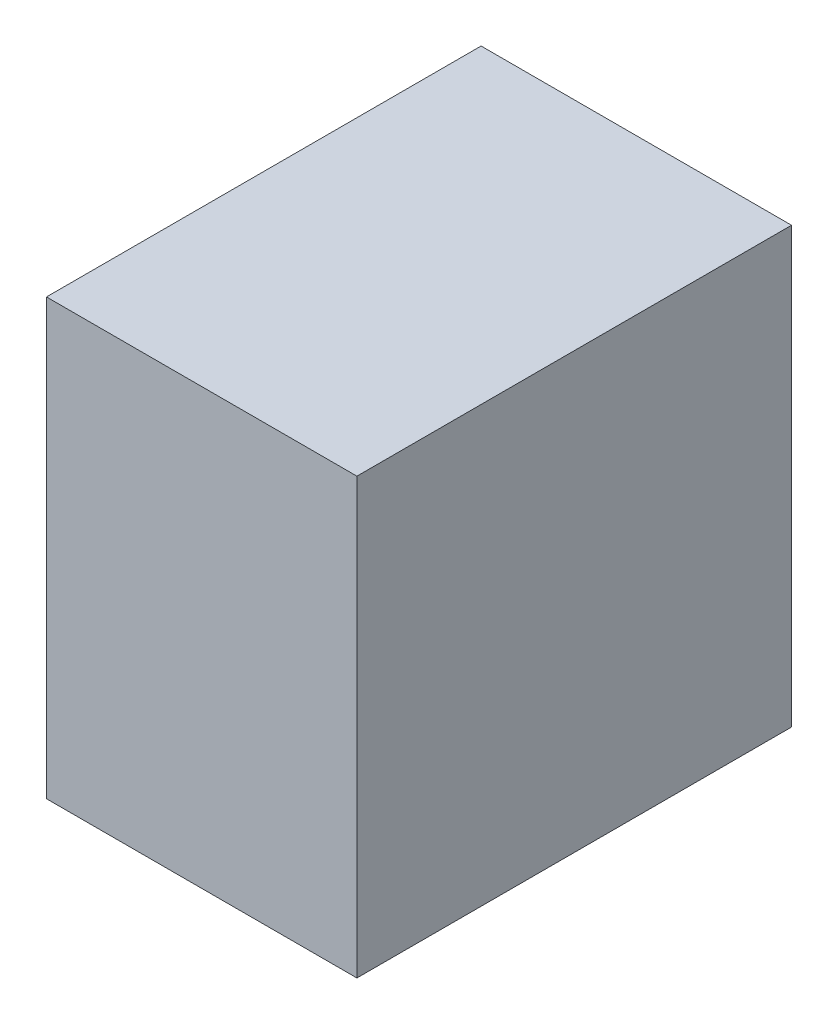
ISO-10303-21;
HEADER;
FILE_DESCRIPTION(('STEP AP214'),'2;1');
FILE_NAME('part.step','',(''),(''),'','','');
FILE_SCHEMA(('AUTOMOTIVE_DESIGN { 1 0 10303 214 1 1 1 1 }'));
ENDSEC;
DATA;
#1=APPLICATION_CONTEXT('core data for automotive mechanical design processes');
#2=APPLICATION_PROTOCOL_DEFINITION('international standard','automotive_design',2000,#1);
#3=PRODUCT_CONTEXT('',#1,'mechanical');
#4=PRODUCT('Part','Part','',(#3));
#5=PRODUCT_RELATED_PRODUCT_CATEGORY('part','',(#4));
#6=PRODUCT_DEFINITION_FORMATION('','',#4);
#7=PRODUCT_DEFINITION_CONTEXT('part definition',#1,'design');
#8=PRODUCT_DEFINITION('design','',#6,#7);
#9=PRODUCT_DEFINITION_SHAPE('','',#8);
#10=(LENGTH_UNIT() NAMED_UNIT(*) SI_UNIT(.MILLI.,.METRE.));
#11=(NAMED_UNIT(*) PLANE_ANGLE_UNIT() SI_UNIT($,.RADIAN.));
#12=(NAMED_UNIT(*) SI_UNIT($,.STERADIAN.) SOLID_ANGLE_UNIT());
#13=UNCERTAINTY_MEASURE_WITH_UNIT(LENGTH_MEASURE(1.E-05),#10,'distance_accuracy_value','');
#14=(GEOMETRIC_REPRESENTATION_CONTEXT(3) GLOBAL_UNCERTAINTY_ASSIGNED_CONTEXT((#13)) GLOBAL_UNIT_ASSIGNED_CONTEXT((#10,
#11,#12)) REPRESENTATION_CONTEXT('',''));
#15=CARTESIAN_POINT('',(0.,0.,0.));
#16=DIRECTION('',(0.,0.,1.));
#17=DIRECTION('',(1.,0.,0.));
#18=AXIS2_PLACEMENT_3D('',#15,#16,#17);
#19=CARTESIAN_POINT('',(15.24,-0.35,-2.08));
#20=DIRECTION('',(-1.,0.,0.));
#21=DIRECTION('',(0.,0.,1.));
#22=AXIS2_PLACEMENT_3D('',#19,#20,#21);
#23=PLANE('',#22);
#24=DIRECTION('',(0.,0.,1.));
#25=VECTOR('',#24,1.);
#26=CARTESIAN_POINT('',(15.24,0.,0.));
#27=LINE('',#26,#25);
#28=CARTESIAN_POINT('',(15.24,0.,0.749999999999982));
#29=VERTEX_POINT('',#28);
#30=CARTESIAN_POINT('',(15.24,0.,1.1));
#31=VERTEX_POINT('',#30);
#32=EDGE_CURVE('E11',#29,#31,#27,.T.);
#33=ORIENTED_EDGE('',*,*,#32,.T.);
#34=DIRECTION('',(0.,-1.,0.));
#35=VECTOR('',#34,1.);
#36=CARTESIAN_POINT('',(15.24,-0.35,1.1));
#37=LINE('',#36,#35);
#38=CARTESIAN_POINT('',(15.24,-0.35,1.1));
#39=VERTEX_POINT('',#38);
#40=EDGE_CURVE('E115',#31,#39,#37,.T.);
#41=ORIENTED_EDGE('',*,*,#40,.T.);
#42=DIRECTION('',(0.,0.,1.));
#43=VECTOR('',#42,1.);
#44=CARTESIAN_POINT('',(15.24,-0.35,-2.08));
#45=LINE('',#44,#43);
#46=CARTESIAN_POINT('',(15.24,-0.35,0.749999999999982));
#47=VERTEX_POINT('',#46);
#48=EDGE_CURVE('E25',#47,#39,#45,.T.);
#49=ORIENTED_EDGE('',*,*,#48,.F.);
#50=DIRECTION('',(0.,-1.,0.));
#51=VECTOR('',#50,1.);
#52=CARTESIAN_POINT('',(15.24,-0.35,0.749999999999982));
#53=LINE('',#52,#51);
#54=EDGE_CURVE('E88',#29,#47,#53,.T.);
#55=ORIENTED_EDGE('',*,*,#54,.F.);
#56=EDGE_LOOP('',(#33,#41,#49,#55));
#57=FACE_BOUND('',#56,.T.);
#58=ADVANCED_FACE('F16',(#57),#23,.F.);
#59=CARTESIAN_POINT('',(0.,0.,0.));
#60=DIRECTION('',(0.,1.,0.));
#61=DIRECTION('',(1.,0.,0.));
#62=AXIS2_PLACEMENT_3D('',#59,#60,#61);
#63=PLANE('',#62);
#64=ORIENTED_EDGE('',*,*,#32,.F.);
#65=DIRECTION('',(1.,0.,0.));
#66=VECTOR('',#65,1.);
#67=CARTESIAN_POINT('',(14.99,0.,0.749999999999982));
#68=LINE('',#67,#66);
#69=CARTESIAN_POINT('',(14.99,0.,0.749999999999982));
#70=VERTEX_POINT('',#69);
#71=EDGE_CURVE('E87',#70,#29,#68,.T.);
#72=ORIENTED_EDGE('',*,*,#71,.F.);
#73=DIRECTION('',(0.,0.,1.));
#74=VECTOR('',#73,1.);
#75=CARTESIAN_POINT('',(14.99,0.,0.749999999999982));
#76=LINE('',#75,#74);
#77=CARTESIAN_POINT('',(14.99,0.,1.1));
#78=VERTEX_POINT('',#77);
#79=EDGE_CURVE('E107',#70,#78,#76,.T.);
#80=ORIENTED_EDGE('',*,*,#79,.T.);
#81=DIRECTION('',(1.,0.,0.));
#82=VECTOR('',#81,1.);
#83=CARTESIAN_POINT('',(14.99,0.,1.1));
#84=LINE('',#83,#82);
#85=EDGE_CURVE('E19',#78,#31,#84,.T.);
#86=ORIENTED_EDGE('',*,*,#85,.T.);
#87=EDGE_LOOP('',(#64,#72,#80,#86));
#88=FACE_BOUND('',#87,.T.);
#89=ADVANCED_FACE('F84',(#88),#63,.T.);
#90=CARTESIAN_POINT('',(0.,-0.35,0.));
#91=DIRECTION('',(0.,1.,0.));
#92=DIRECTION('',(1.,0.,0.));
#93=AXIS2_PLACEMENT_3D('',#90,#91,#92);
#94=PLANE('',#93);
#95=DIRECTION('',(1.,0.,0.));
#96=VECTOR('',#95,1.);
#97=CARTESIAN_POINT('',(14.99,-0.35,0.749999999999982));
#98=LINE('',#97,#96);
#99=CARTESIAN_POINT('',(14.99,-0.35,0.749999999999982));
#100=VERTEX_POINT('',#99);
#101=EDGE_CURVE('E66',#100,#47,#98,.T.);
#102=ORIENTED_EDGE('',*,*,#101,.T.);
#103=ORIENTED_EDGE('',*,*,#48,.T.);
#104=DIRECTION('',(1.,0.,0.));
#105=VECTOR('',#104,1.);
#106=CARTESIAN_POINT('',(14.99,-0.35,1.1));
#107=LINE('',#106,#105);
#108=CARTESIAN_POINT('',(14.99,-0.35,1.1));
#109=VERTEX_POINT('',#108);
#110=EDGE_CURVE('E106',#109,#39,#107,.T.);
#111=ORIENTED_EDGE('',*,*,#110,.F.);
#112=DIRECTION('',(0.,0.,1.));
#113=VECTOR('',#112,1.);
#114=CARTESIAN_POINT('',(14.99,-0.35,0.749999999999982));
#115=LINE('',#114,#113);
#116=EDGE_CURVE('E103',#100,#109,#115,.T.);
#117=ORIENTED_EDGE('',*,*,#116,.F.);
#118=EDGE_LOOP('',(#102,#103,#111,#117));
#119=FACE_BOUND('',#118,.T.);
#120=ADVANCED_FACE('F171',(#119),#94,.F.);
#121=CARTESIAN_POINT('',(14.99,-0.35,1.1));
#122=DIRECTION('',(0.,0.,1.));
#123=DIRECTION('',(1.,0.,0.));
#124=AXIS2_PLACEMENT_3D('',#121,#122,#123);
#125=PLANE('',#124);
#126=ORIENTED_EDGE('',*,*,#40,.F.);
#127=ORIENTED_EDGE('',*,*,#85,.F.);
#128=DIRECTION('',(0.,1.,0.));
#129=VECTOR('',#128,1.);
#130=CARTESIAN_POINT('',(14.99,-0.35,1.1));
#131=LINE('',#130,#129);
#132=EDGE_CURVE('E96',#109,#78,#131,.T.);
#133=ORIENTED_EDGE('',*,*,#132,.F.);
#134=ORIENTED_EDGE('',*,*,#110,.T.);
#135=EDGE_LOOP('',(#126,#127,#133,#134));
#136=FACE_BOUND('',#135,.T.);
#137=ADVANCED_FACE('F166',(#136),#125,.T.);
#138=CARTESIAN_POINT('',(14.99,-0.35,0.749999999999982));
#139=DIRECTION('',(0.,0.,1.));
#140=DIRECTION('',(1.,0.,0.));
#141=AXIS2_PLACEMENT_3D('',#138,#139,#140);
#142=PLANE('',#141);
#143=ORIENTED_EDGE('',*,*,#71,.T.);
#144=ORIENTED_EDGE('',*,*,#54,.T.);
#145=ORIENTED_EDGE('',*,*,#101,.F.);
#146=DIRECTION('',(0.,1.,0.));
#147=VECTOR('',#146,1.);
#148=CARTESIAN_POINT('',(14.99,-0.35,0.749999999999982));
#149=LINE('',#148,#147);
#150=EDGE_CURVE('E93',#100,#70,#149,.T.);
#151=ORIENTED_EDGE('',*,*,#150,.T.);
#152=EDGE_LOOP('',(#143,#144,#145,#151));
#153=FACE_BOUND('',#152,.T.);
#154=ADVANCED_FACE('F91',(#153),#142,.F.);
#155=CARTESIAN_POINT('',(14.99,-0.35,0.749999999999982));
#156=DIRECTION('',(-1.,0.,0.));
#157=DIRECTION('',(0.,0.,1.));
#158=AXIS2_PLACEMENT_3D('',#155,#156,#157);
#159=PLANE('',#158);
#160=ORIENTED_EDGE('',*,*,#79,.F.);
#161=ORIENTED_EDGE('',*,*,#150,.F.);
#162=ORIENTED_EDGE('',*,*,#116,.T.);
#163=ORIENTED_EDGE('',*,*,#132,.T.);
#164=EDGE_LOOP('',(#160,#161,#162,#163));
#165=FACE_BOUND('',#164,.T.);
#166=ADVANCED_FACE('F165',(#165),#159,.T.);
#167=CLOSED_SHELL('',(#58,#89,#120,#137,#154,#166));
#168=MANIFOLD_SOLID_BREP('B1',#167);
#169=ADVANCED_BREP_SHAPE_REPRESENTATION('',(#18,#168),#14);
#170=SHAPE_DEFINITION_REPRESENTATION(#9,#169);
ENDSEC;
END-ISO-10303-21;
